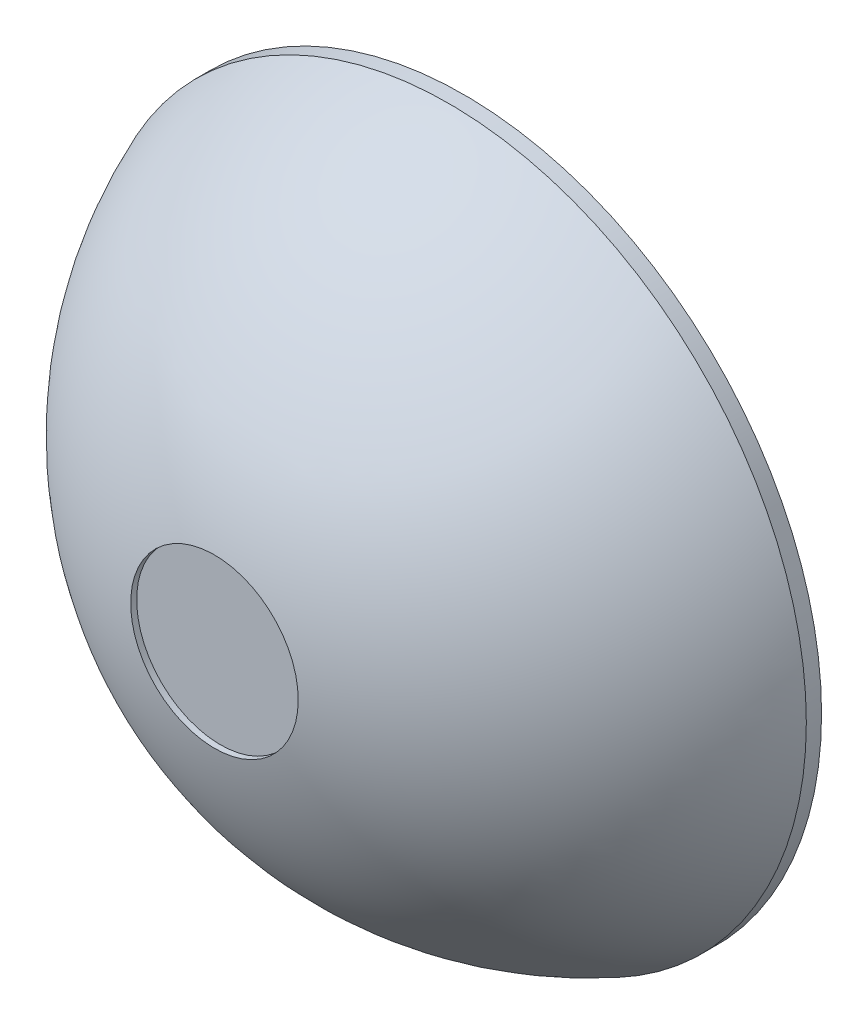
ISO-10303-21;
HEADER;
FILE_DESCRIPTION(('STEP AP214'),'2;1');
FILE_NAME('part.step','',(''),(''),'','','');
FILE_SCHEMA(('AUTOMOTIVE_DESIGN { 1 0 10303 214 1 1 1 1 }'));
ENDSEC;
DATA;
#1=APPLICATION_CONTEXT('core data for automotive mechanical design processes');
#2=APPLICATION_PROTOCOL_DEFINITION('international standard','automotive_design',2000,#1);
#3=PRODUCT_CONTEXT('',#1,'mechanical');
#4=PRODUCT('Part','Part','',(#3));
#5=PRODUCT_RELATED_PRODUCT_CATEGORY('part','',(#4));
#6=PRODUCT_DEFINITION_FORMATION('','',#4);
#7=PRODUCT_DEFINITION_CONTEXT('part definition',#1,'design');
#8=PRODUCT_DEFINITION('design','',#6,#7);
#9=PRODUCT_DEFINITION_SHAPE('','',#8);
#10=(LENGTH_UNIT() NAMED_UNIT(*) SI_UNIT(.MILLI.,.METRE.));
#11=(NAMED_UNIT(*) PLANE_ANGLE_UNIT() SI_UNIT($,.RADIAN.));
#12=(NAMED_UNIT(*) SI_UNIT($,.STERADIAN.) SOLID_ANGLE_UNIT());
#13=UNCERTAINTY_MEASURE_WITH_UNIT(LENGTH_MEASURE(1.E-05),#10,'distance_accuracy_value','');
#14=(GEOMETRIC_REPRESENTATION_CONTEXT(3) GLOBAL_UNCERTAINTY_ASSIGNED_CONTEXT((#13)) GLOBAL_UNIT_ASSIGNED_CONTEXT((#10,
#11,#12)) REPRESENTATION_CONTEXT('',''));
#15=CARTESIAN_POINT('',(0.,0.,0.));
#16=DIRECTION('',(0.,0.,1.));
#17=DIRECTION('',(1.,0.,0.));
#18=AXIS2_PLACEMENT_3D('',#15,#16,#17);
#19=CARTESIAN_POINT('',(0.,0.,-6.25517333333333));
#20=DIRECTION('',(0.,0.,1.));
#21=DIRECTION('',(1.,0.,0.));
#22=AXIS2_PLACEMENT_3D('',#19,#20,#21);
#23=SPHERICAL_SURFACE('',#22,19.2091733333333);
#24=CARTESIAN_POINT('',(0.,0.,0.762));
#25=DIRECTION('',(0.,0.,1.));
#26=DIRECTION('',(1.,0.,0.));
#27=AXIS2_PLACEMENT_3D('',#24,#25,#26);
#28=CIRCLE('',#27,17.8816);
#29=CARTESIAN_POINT('',(17.8816,0.,0.762000000000001));
#30=VERTEX_POINT('',#29);
#31=EDGE_CURVE('E10',#30,#30,#28,.T.);
#32=CARTESIAN_POINT('',(0.,0.,12.4912359001717));
#33=DIRECTION('',(0.,0.,-1.));
#34=DIRECTION('',(-1.,0.,0.));
#35=AXIS2_PLACEMENT_3D('',#32,#33,#34);
#36=CIRCLE('',#35,4.191);
#37=CARTESIAN_POINT('',(4.19100000000002,0.,12.4912359001717));
#38=VERTEX_POINT('',#37);
#39=EDGE_CURVE('E34',#38,#38,#36,.T.);
#40=CARTESIAN_POINT('',(17.8816,0.,0.762000000000001));
#41=CARTESIAN_POINT('',(17.8101944768594,0.,0.943962752623848));
#42=CARTESIAN_POINT('',(17.7360096867576,0.,1.12483479680445));
#43=CARTESIAN_POINT('',(17.582154735289,0.,1.484230643402));
#44=CARTESIAN_POINT('',(17.5024845739224,0.,1.66275444581895));
#45=CARTESIAN_POINT('',(17.3377320425822,0.,2.01728698401207));
#46=CARTESIAN_POINT('',(17.2526496726087,0.,2.19329571978824));
#47=CARTESIAN_POINT('',(17.0771522999074,0.,2.54263422990503));
#48=CARTESIAN_POINT('',(16.9867372971796,0.,2.71596400424565));
#49=CARTESIAN_POINT('',(16.8006588371828,0.,3.05978303605126));
#50=CARTESIAN_POINT('',(16.7049953799139,0.,3.23027229351624));
#51=CARTESIAN_POINT('',(16.508509178307,0.,3.56825142524404));
#52=CARTESIAN_POINT('',(16.407686433969,0.,3.73574129950686));
#53=CARTESIAN_POINT('',(16.2009756071733,0.,4.06756558228354));
#54=CARTESIAN_POINT('',(16.0950875247157,0.,4.2318999907974));
#55=CARTESIAN_POINT('',(15.8783446979688,0.,4.55726020306164));
#56=CARTESIAN_POINT('',(15.7674899536795,0.,4.71828600681201));
#57=CARTESIAN_POINT('',(15.5409171059894,0.,5.03687895294152));
#58=CARTESIAN_POINT('',(15.4251990025886,0.,5.19444609532065));
#59=CARTESIAN_POINT('',(15.1890072719608,0.,5.50597488536806));
#60=CARTESIAN_POINT('',(15.0685336447338,0.,5.65993653303634));
#61=CARTESIAN_POINT('',(14.8229431331722,0.,5.96411086014623));
#62=CARTESIAN_POINT('',(14.6978262488375,0.,6.11432353958784));
#63=CARTESIAN_POINT('',(14.4430658167656,0.,6.41085995032593));
#64=CARTESIAN_POINT('',(14.3134222690283,0.,6.5571836816224));
#65=CARTESIAN_POINT('',(14.0497293221453,0.,6.84580584017359));
#66=CARTESIAN_POINT('',(13.9156799229995,0.,6.98810426742829));
#67=CARTESIAN_POINT('',(13.6433001910133,0.,7.26854321309352));
#68=CARTESIAN_POINT('',(13.5049698581729,0.,7.40668373150404));
#69=CARTESIAN_POINT('',(13.2241571658191,0.,7.6786781293428));
#70=CARTESIAN_POINT('',(13.0816748063057,0.,7.81253200877104));
#71=CARTESIAN_POINT('',(12.7926908368112,0.,8.07582839313264));
#72=CARTESIAN_POINT('',(12.6461892268301,0.,8.20527089806601));
#73=CARTESIAN_POINT('',(12.3493032780572,0.,8.45962390878901));
#74=CARTESIAN_POINT('',(12.1989189392653,0.,8.58453441457863));
#75=CARTESIAN_POINT('',(11.8944076727583,0.,8.82970702563651));
#76=CARTESIAN_POINT('',(11.7402807450431,0.,8.94996913090477));
#77=CARTESIAN_POINT('',(11.4284279282137,0.,9.18573287128532));
#78=CARTESIAN_POINT('',(11.2707020390995,0.,9.30123450639763));
#79=CARTESIAN_POINT('',(10.9517982807902,0.,9.5273696730103));
#80=CARTESIAN_POINT('',(10.7906204115952,0.,9.63800320451067));
#81=CARTESIAN_POINT('',(10.4649628912672,0.,9.85429906692238));
#82=CARTESIAN_POINT('',(10.3004832401343,0.,9.95996139783372));
#83=CARTESIAN_POINT('',(9.96837543093269,0.,10.1662163946465));
#84=CARTESIAN_POINT('',(9.80074727286407,0.,10.2668090605479));
#85=CARTESIAN_POINT('',(9.46249865881578,0.,10.4628309872201));
#86=CARTESIAN_POINT('',(9.29187820283611,0.,10.5582602479909));
#87=CARTESIAN_POINT('',(8.94780399045733,0.,10.7438664359838));
#88=CARTESIAN_POINT('',(8.77435023405823,0.,10.8340433632061));
#89=CARTESIAN_POINT('',(8.42477105858649,0.,11.0090608500763));
#90=CARTESIAN_POINT('',(8.24864563951386,0.,11.0939014097243));
#91=CARTESIAN_POINT('',(7.89388726624186,0.,11.2581671007991));
#92=CARTESIAN_POINT('',(7.71525431204248,0.,11.3375922322259));
#93=CARTESIAN_POINT('',(7.35564733227104,0.,11.4909530507372));
#94=CARTESIAN_POINT('',(7.17467330669897,0.,11.5648887378217));
#95=CARTESIAN_POINT('',(6.81055283143316,0.,11.7072017744614));
#96=CARTESIAN_POINT('',(6.62740638173944,0.,11.7755791240165));
#97=CARTESIAN_POINT('',(6.25911172281166,0.,11.9067117443357));
#98=CARTESIAN_POINT('',(6.0739635135776,0.,11.9694670150998));
#99=CARTESIAN_POINT('',(5.70183789206057,0.,12.0892970793001));
#100=CARTESIAN_POINT('',(5.51486047977759,0.,12.1463718727363));
#101=CARTESIAN_POINT('',(5.139250614297,0.,12.2547874904964));
#102=CARTESIAN_POINT('',(4.95061816109939,0.,12.3061283148202));
#103=CARTESIAN_POINT('',(4.57187428751261,0.,12.4030292893428));
#104=CARTESIAN_POINT('',(4.38176286712344,0.,12.4485894395416));
#105=CARTESIAN_POINT('',(4.19100000000002,0.,12.4912359001717));
#106=B_SPLINE_CURVE_WITH_KNOTS('',3,(#40,#41,#42,#43,#44,#45,#46,#47,#48,#49,#50,#51,#52,#53,
#54,#55,#56,#57,#58,#59,#60,#61,#62,#63,#64,#65,#66,#67,#68,#69,#70,#71,#72,#73,#74,#75,#76,#77,
#78,#79,#80,#81,#82,#83,#84,#85,#86,#87,#88,#89,#90,#91,#92,#93,#94,#95,#96,#97,#98,#99,#100,
#101,#102,#103,#104,#105),.UNSPECIFIED.,.F.,.F.,(4,2,2,2,2,2,2,2,2,2,2,2,2,2,2,2,2,2,2,2,2,2,2,
2,2,2,2,2,2,2,2,2,4),(0.,0.586392290871636,1.17278458174327,1.7591768726149,2.34556916348654,
2.93196145435817,3.51835374522981,4.10474603610144,4.69113832697307,5.27753061784471,
5.86392290871635,6.45031519958798,7.03670749045961,7.62309978133125,8.20949207220288,
8.79588436307452,9.38227665394615,9.96866894481778,10.5550612356894,11.1414535265611,
11.7278458174327,12.3142381083043,12.900630399176,13.4870226900476,14.0734149809192,
14.6598072717909,15.2461995626625,15.8325918535341,16.4189841444058,17.0053764352774,
17.591768726149,18.1781610170207,18.7645533078923),.UNSPECIFIED.);
#107=EDGE_CURVE('BSEAM31',#30,#38,#106,.T.);
#108=ORIENTED_EDGE('',*,*,#31,.T.);
#109=ORIENTED_EDGE('',*,*,#39,.T.);
#110=ORIENTED_EDGE('',*,*,#107,.T.);
#111=ORIENTED_EDGE('',*,*,#107,.F.);
#112=EDGE_LOOP('',(#108,#110,#109,#111));
#113=FACE_BOUND('',#112,.T.);
#114=ADVANCED_FACE('F31',(#113),#23,.T.);
#115=CARTESIAN_POINT('',(0.,0.,0.762));
#116=DIRECTION('',(0.,0.,-1.));
#117=DIRECTION('',(-1.,0.,0.));
#118=AXIS2_PLACEMENT_3D('',#115,#116,#117);
#119=CYLINDRICAL_SURFACE('',#118,17.8816);
#120=ORIENTED_EDGE('',*,*,#31,.F.);
#121=EDGE_LOOP('',(#120));
#122=FACE_BOUND('',#121,.T.);
#123=CARTESIAN_POINT('',(0.,0.,0.));
#124=DIRECTION('',(0.,0.,1.));
#125=DIRECTION('',(1.,0.,0.));
#126=AXIS2_PLACEMENT_3D('',#123,#124,#125);
#127=CIRCLE('',#126,17.8816);
#128=CARTESIAN_POINT('',(17.8816,0.,0.));
#129=VERTEX_POINT('',#128);
#130=EDGE_CURVE('E38',#129,#129,#127,.T.);
#131=ORIENTED_EDGE('',*,*,#130,.T.);
#132=EDGE_LOOP('',(#131));
#133=FACE_BOUND('',#132,.T.);
#134=ADVANCED_FACE('F81',(#122,#133),#119,.T.);
#135=CARTESIAN_POINT('',(0.,0.,0.));
#136=DIRECTION('',(0.,0.,1.));
#137=DIRECTION('',(1.,0.,0.));
#138=AXIS2_PLACEMENT_3D('',#135,#136,#137);
#139=PLANE('',#138);
#140=CARTESIAN_POINT('',(0.,0.,0.));
#141=DIRECTION('',(0.,0.,-1.));
#142=DIRECTION('',(-1.,0.,0.));
#143=AXIS2_PLACEMENT_3D('',#140,#141,#142);
#144=CIRCLE('',#143,17.3736);
#145=CARTESIAN_POINT('',(-17.3736,0.,0.));
#146=VERTEX_POINT('',#145);
#147=EDGE_CURVE('E48',#146,#146,#144,.T.);
#148=ORIENTED_EDGE('',*,*,#147,.F.);
#149=EDGE_LOOP('',(#148));
#150=FACE_BOUND('',#149,.T.);
#151=ORIENTED_EDGE('',*,*,#130,.F.);
#152=EDGE_LOOP('',(#151));
#153=FACE_BOUND('',#152,.T.);
#154=ADVANCED_FACE('F85',(#150,#153),#139,.F.);
#155=CARTESIAN_POINT('',(0.,0.,13.208));
#156=DIRECTION('',(0.,0.,-1.));
#157=DIRECTION('',(-1.,0.,0.));
#158=AXIS2_PLACEMENT_3D('',#155,#156,#157);
#159=CYLINDRICAL_SURFACE('',#158,4.191);
#160=ORIENTED_EDGE('',*,*,#39,.F.);
#161=EDGE_LOOP('',(#160));
#162=FACE_BOUND('',#161,.T.);
#163=CARTESIAN_POINT('',(0.,0.,12.192));
#164=DIRECTION('',(0.,0.,1.));
#165=DIRECTION('',(1.,0.,0.));
#166=AXIS2_PLACEMENT_3D('',#163,#164,#165);
#167=CIRCLE('',#166,4.191);
#168=CARTESIAN_POINT('',(4.191,0.,12.192));
#169=VERTEX_POINT('',#168);
#170=EDGE_CURVE('E44',#169,#169,#167,.T.);
#171=ORIENTED_EDGE('',*,*,#170,.F.);
#172=EDGE_LOOP('',(#171));
#173=FACE_BOUND('',#172,.T.);
#174=ADVANCED_FACE('F91',(#162,#173),#159,.F.);
#175=CARTESIAN_POINT('',(0.,0.,12.192));
#176=DIRECTION('',(0.,0.,1.));
#177=DIRECTION('',(1.,0.,0.));
#178=AXIS2_PLACEMENT_3D('',#175,#176,#177);
#179=PLANE('',#178);
#180=ORIENTED_EDGE('',*,*,#170,.T.);
#181=EDGE_LOOP('',(#180));
#182=FACE_BOUND('',#181,.T.);
#183=ADVANCED_FACE('F94',(#182),#179,.T.);
#184=CARTESIAN_POINT('',(0.,0.,1.27));
#185=DIRECTION('',(0.,0.,-1.));
#186=DIRECTION('',(-1.,0.,0.));
#187=AXIS2_PLACEMENT_3D('',#184,#185,#186);
#188=CYLINDRICAL_SURFACE('',#187,17.3736);
#189=CARTESIAN_POINT('',(0.,0.,1.27));
#190=DIRECTION('',(0.,0.,-1.));
#191=DIRECTION('',(-1.,0.,0.));
#192=AXIS2_PLACEMENT_3D('',#189,#190,#191);
#193=CIRCLE('',#192,17.3736);
#194=CARTESIAN_POINT('',(-17.3736,0.,1.27));
#195=VERTEX_POINT('',#194);
#196=EDGE_CURVE('E47',#195,#195,#193,.T.);
#197=ORIENTED_EDGE('',*,*,#196,.F.);
#198=EDGE_LOOP('',(#197));
#199=FACE_BOUND('',#198,.T.);
#200=ORIENTED_EDGE('',*,*,#147,.T.);
#201=EDGE_LOOP('',(#200));
#202=FACE_BOUND('',#201,.T.);
#203=ADVANCED_FACE('F77',(#199,#202),#188,.F.);
#204=CARTESIAN_POINT('',(0.,0.,1.27));
#205=DIRECTION('',(0.,0.,-1.));
#206=DIRECTION('',(-1.,0.,0.));
#207=AXIS2_PLACEMENT_3D('',#204,#205,#206);
#208=PLANE('',#207);
#209=CARTESIAN_POINT('',(0.,0.,1.27));
#210=DIRECTION('',(0.,0.,-1.));
#211=DIRECTION('',(-1.,0.,0.));
#212=AXIS2_PLACEMENT_3D('',#209,#210,#211);
#213=CIRCLE('',#212,17.1203285700557);
#214=CARTESIAN_POINT('',(17.1203285700557,0.,1.27));
#215=VERTEX_POINT('',#214);
#216=EDGE_CURVE('E51',#215,#215,#213,.T.);
#217=ORIENTED_EDGE('',*,*,#216,.F.);
#218=EDGE_LOOP('',(#217));
#219=FACE_BOUND('',#218,.T.);
#220=ORIENTED_EDGE('',*,*,#196,.T.);
#221=EDGE_LOOP('',(#220));
#222=FACE_BOUND('',#221,.T.);
#223=ADVANCED_FACE('F68',(#219,#222),#208,.T.);
#224=CARTESIAN_POINT('',(0.,0.,-6.25517333333333));
#225=DIRECTION('',(0.,0.,1.));
#226=DIRECTION('',(1.,0.,0.));
#227=AXIS2_PLACEMENT_3D('',#224,#225,#226);
#228=SPHERICAL_SURFACE('',#227,18.7011733333333);
#229=CARTESIAN_POINT('',(0.,0.,11.8460222913589));
#230=DIRECTION('',(0.,0.,-1.));
#231=DIRECTION('',(-1.,0.,0.));
#232=AXIS2_PLACEMENT_3D('',#229,#230,#231);
#233=CIRCLE('',#232,4.699);
#234=CARTESIAN_POINT('',(4.69900000000001,0.,11.8460222913589));
#235=VERTEX_POINT('',#234);
#236=EDGE_CURVE('E56',#235,#235,#233,.T.);
#237=CARTESIAN_POINT('',(17.1203285700557,0.,1.27));
#238=CARTESIAN_POINT('',(17.0495706250339,0.,1.43098134396497));
#239=CARTESIAN_POINT('',(16.9765408827857,0.,1.5909640905406));
#240=CARTESIAN_POINT('',(16.8259987252429,0.,1.90880642603576));
#241=CARTESIAN_POINT('',(16.7484863099483,0.,2.06666601495528));
#242=CARTESIAN_POINT('',(16.5890397277198,0.,2.38013607226082));
#243=CARTESIAN_POINT('',(16.5071055607858,0.,2.53574654064683));
#244=CARTESIAN_POINT('',(16.3388808707039,0.,2.844594636252));
#245=CARTESIAN_POINT('',(16.2525903475561,0.,2.99783226347116));
#246=CARTESIAN_POINT('',(16.075721550659,0.,3.3018127228436));
#247=CARTESIAN_POINT('',(15.9851432769098,0.,3.45255555499688));
#248=CARTESIAN_POINT('',(15.7997710647212,0.,3.75142648789917));
#249=CARTESIAN_POINT('',(15.7049771262819,0.,3.89955458864818));
#250=CARTESIAN_POINT('',(15.5112490065628,0.,4.19307819418741));
#251=CARTESIAN_POINT('',(15.4123148252831,0.,4.33847369897762));
#252=CARTESIAN_POINT('',(15.2103849409718,0.,4.62641642465272));
#253=CARTESIAN_POINT('',(15.1073892379403,0.,4.7689636455376));
#254=CARTESIAN_POINT('',(14.8974182615698,0.,5.05109638115568));
#255=CARTESIAN_POINT('',(14.7904429882308,0.,5.19068189588887));
#256=CARTESIAN_POINT('',(14.5725979895119,0.,5.46678015369801));
#257=CARTESIAN_POINT('',(14.4617282641319,0.,5.60329289677395));
#258=CARTESIAN_POINT('',(14.2361825782441,0.,5.87313699066416));
#259=CARTESIAN_POINT('',(14.1215066177362,0.,6.00646834147842));
#260=CARTESIAN_POINT('',(13.8884397070802,0.,6.26984356162619));
#261=CARTESIAN_POINT('',(13.7700487569319,0.,6.39988743095971));
#262=CARTESIAN_POINT('',(13.5296460684224,0.,6.65658421471025));
#263=CARTESIAN_POINT('',(13.4076343300611,0.,6.78323712912727));
#264=CARTESIAN_POINT('',(13.160087147547,0.,7.03305122772831));
#265=CARTESIAN_POINT('',(13.0345517033942,0.,7.15621241191232));
#266=CARTESIAN_POINT('',(12.7800569954637,0.,7.39894505303398));
#267=CARTESIAN_POINT('',(12.6510977316861,0.,7.51851650997163));
#268=CARTESIAN_POINT('',(12.3898579949411,0.,7.75397455586498));
#269=CARTESIAN_POINT('',(12.2575775219737,0.,7.86986114482068));
#270=CARTESIAN_POINT('',(11.9898006199073,0.,8.09785724599399));
#271=CARTESIAN_POINT('',(11.8543041908083,0.,8.20996675821159));
#272=CARTESIAN_POINT('',(11.5802031884118,0.,8.43031950250071));
#273=CARTESIAN_POINT('',(11.4415986151143,0.,8.53856273457222));
#274=CARTESIAN_POINT('',(11.1613916093455,0.,8.75109679148676));
#275=CARTESIAN_POINT('',(11.019789176874,0.,8.85538761632979));
#276=CARTESIAN_POINT('',(10.7336991231214,0.,9.05993387656041));
#277=CARTESIAN_POINT('',(10.5892115018402,0.,9.160189311948));
#278=CARTESIAN_POINT('',(10.2974660365217,0.,9.35658502192296));
#279=CARTESIAN_POINT('',(10.1502081924844,0.,9.45272529651033));
#280=CARTESIAN_POINT('',(9.85303945192194,0.,9.64081418789725));
#281=CARTESIAN_POINT('',(9.70312855539669,0.,9.73276280469679));
#282=CARTESIAN_POINT('',(9.40077299110754,0.,9.91239521873563));
#283=CARTESIAN_POINT('',(9.24832832334363,0.,10.0000790159749));
#284=CARTESIAN_POINT('',(8.94102651390793,0.,10.1711120225837));
#285=CARTESIAN_POINT('',(8.78616937223614,0.,10.2544612319532));
#286=CARTESIAN_POINT('',(8.47416583184587,0.,10.4167587433613));
#287=CARTESIAN_POINT('',(8.3170194331274,0.,10.4957070453999));
#288=CARTESIAN_POINT('',(8.0005624171323,0.,10.6491399247793));
#289=CARTESIAN_POINT('',(7.84125179985567,0.,10.72362450212));
#290=CARTESIAN_POINT('',(7.5205931068536,0.,10.8680706650349));
#291=CARTESIAN_POINT('',(7.35924503112815,0.,10.9380322506091));
#292=CARTESIAN_POINT('',(7.03463980402273,0.,11.0733767670159));
#293=CARTESIAN_POINT('',(6.87138265264275,0.,11.1387596978487));
#294=CARTESIAN_POINT('',(6.54308917037261,0.,11.2648948654073));
#295=CARTESIAN_POINT('',(6.37805283948245,0.,11.3256471021332));
#296=CARTESIAN_POINT('',(6.0463323311382,0.,11.4424725995894));
#297=CARTESIAN_POINT('',(5.87964815368411,0.,11.4985458603198));
#298=CARTESIAN_POINT('',(5.54476451741326,0.,11.6059685747219));
#299=CARTESIAN_POINT('',(5.3765650585965,0.,11.6573180283936));
#300=CARTESIAN_POINT('',(5.03878492496029,0.,11.7552530719243));
#301=CARTESIAN_POINT('',(4.86920425014083,0.,11.8018386617833));
#302=CARTESIAN_POINT('',(4.69900000000001,0.,11.8460222913589));
#303=B_SPLINE_CURVE_WITH_KNOTS('',3,(#237,#238,#239,#240,#241,#242,#243,#244,#245,#246,#247,
#248,#249,#250,#251,#252,#253,#254,#255,#256,#257,#258,#259,#260,#261,#262,#263,#264,#265,#266,
#267,#268,#269,#270,#271,#272,#273,#274,#275,#276,#277,#278,#279,#280,#281,#282,#283,#284,#285,
#286,#287,#288,#289,#290,#291,#292,#293,#294,#295,#296,#297,#298,#299,#300,#301,#302),
.UNSPECIFIED.,.F.,.F.,(4,2,2,2,2,2,2,2,2,2,2,2,2,2,2,2,2,2,2,2,2,2,2,2,2,2,2,2,2,2,2,2,4),(0.,
0.527519292634804,1.0550385852696,1.58255787790441,2.11007717053921,2.63759646317401,
3.16511575580881,3.69263504844362,4.22015434107842,4.74767363371322,5.27519292634802,
5.80271221898283,6.33023151161763,6.85775080425243,7.38527009688723,7.91278938952204,
8.44030868215684,8.96782797479164,9.49534726742644,10.0228665600612,10.550385852696,
11.0779051453309,11.6054244379657,12.1329437306005,12.6604630232353,13.1879823158701,
13.7155016085049,14.2430209011397,14.7705401937745,15.2980594864093,15.8255787790441,
16.3530980716789,16.8806173643137),.UNSPECIFIED.);
#304=EDGE_CURVE('BSEAM66',#215,#235,#303,.T.);
#305=ORIENTED_EDGE('',*,*,#216,.T.);
#306=ORIENTED_EDGE('',*,*,#236,.F.);
#307=ORIENTED_EDGE('',*,*,#304,.T.);
#308=ORIENTED_EDGE('',*,*,#304,.F.);
#309=EDGE_LOOP('',(#305,#307,#306,#308));
#310=FACE_BOUND('',#309,.T.);
#311=ADVANCED_FACE('F66',(#310),#228,.F.);
#312=CARTESIAN_POINT('',(0.,0.,13.208));
#313=DIRECTION('',(0.,0.,-1.));
#314=DIRECTION('',(-1.,0.,0.));
#315=AXIS2_PLACEMENT_3D('',#312,#313,#314);
#316=CYLINDRICAL_SURFACE('',#315,4.699);
#317=ORIENTED_EDGE('',*,*,#236,.T.);
#318=EDGE_LOOP('',(#317));
#319=FACE_BOUND('',#318,.T.);
#320=CARTESIAN_POINT('',(0.,0.,11.684));
#321=DIRECTION('',(0.,0.,1.));
#322=DIRECTION('',(1.,0.,0.));
#323=AXIS2_PLACEMENT_3D('',#320,#321,#322);
#324=CIRCLE('',#323,4.699);
#325=CARTESIAN_POINT('',(4.699,0.,11.684));
#326=VERTEX_POINT('',#325);
#327=EDGE_CURVE('E57',#326,#326,#324,.T.);
#328=ORIENTED_EDGE('',*,*,#327,.T.);
#329=EDGE_LOOP('',(#328));
#330=FACE_BOUND('',#329,.T.);
#331=ADVANCED_FACE('F63',(#319,#330),#316,.T.);
#332=CARTESIAN_POINT('',(0.,0.,11.684));
#333=DIRECTION('',(0.,0.,1.));
#334=DIRECTION('',(1.,0.,0.));
#335=AXIS2_PLACEMENT_3D('',#332,#333,#334);
#336=PLANE('',#335);
#337=ORIENTED_EDGE('',*,*,#327,.F.);
#338=EDGE_LOOP('',(#337));
#339=FACE_BOUND('',#338,.T.);
#340=ADVANCED_FACE('F75',(#339),#336,.F.);
#341=CLOSED_SHELL('',(#114,#134,#154,#174,#183,#203,#223,#311,#331,#340));
#342=MANIFOLD_SOLID_BREP('B2',#341);
#343=ADVANCED_BREP_SHAPE_REPRESENTATION('',(#18,#342),#14);
#344=SHAPE_DEFINITION_REPRESENTATION(#9,#343);
ENDSEC;
END-ISO-10303-21;
